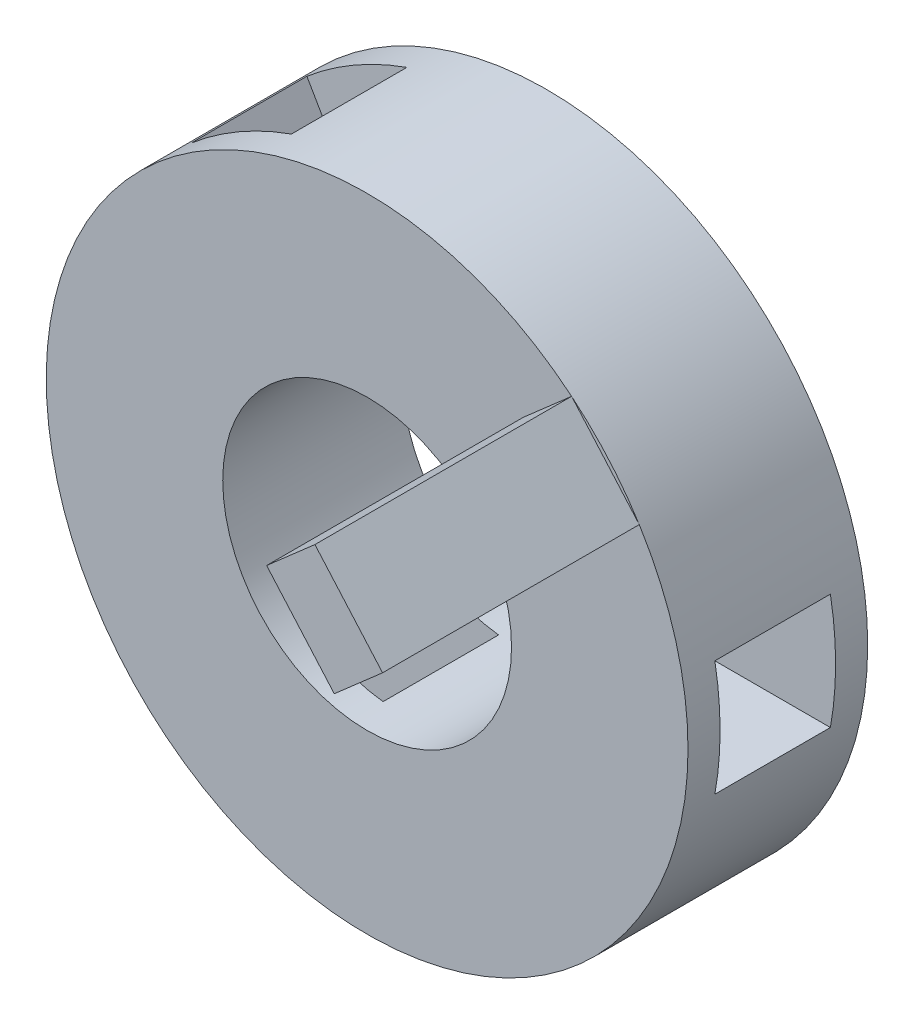
ISO-10303-21;
HEADER;
FILE_DESCRIPTION(('STEP AP214'),'2;1');
FILE_NAME('part.step','',(''),(''),'','','');
FILE_SCHEMA(('AUTOMOTIVE_DESIGN { 1 0 10303 214 1 1 1 1 }'));
ENDSEC;
DATA;
#1=APPLICATION_CONTEXT('core data for automotive mechanical design processes');
#2=APPLICATION_PROTOCOL_DEFINITION('international standard','automotive_design',2000,#1);
#3=PRODUCT_CONTEXT('',#1,'mechanical');
#4=PRODUCT('Part','Part','',(#3));
#5=PRODUCT_RELATED_PRODUCT_CATEGORY('part','',(#4));
#6=PRODUCT_DEFINITION_FORMATION('','',#4);
#7=PRODUCT_DEFINITION_CONTEXT('part definition',#1,'design');
#8=PRODUCT_DEFINITION('design','',#6,#7);
#9=PRODUCT_DEFINITION_SHAPE('','',#8);
#10=(LENGTH_UNIT() NAMED_UNIT(*) SI_UNIT(.MILLI.,.METRE.));
#11=(NAMED_UNIT(*) PLANE_ANGLE_UNIT() SI_UNIT($,.RADIAN.));
#12=(NAMED_UNIT(*) SI_UNIT($,.STERADIAN.) SOLID_ANGLE_UNIT());
#13=UNCERTAINTY_MEASURE_WITH_UNIT(LENGTH_MEASURE(1.E-05),#10,'distance_accuracy_value','');
#14=(GEOMETRIC_REPRESENTATION_CONTEXT(3) GLOBAL_UNCERTAINTY_ASSIGNED_CONTEXT((#13)) GLOBAL_UNIT_ASSIGNED_CONTEXT((#10,
#11,#12)) REPRESENTATION_CONTEXT('',''));
#15=CARTESIAN_POINT('',(0.,0.,0.));
#16=DIRECTION('',(0.,0.,1.));
#17=DIRECTION('',(1.,0.,0.));
#18=AXIS2_PLACEMENT_3D('',#15,#16,#17);
#19=CARTESIAN_POINT('',(0.,0.,14.));
#20=DIRECTION('',(0.,0.,1.));
#21=DIRECTION('',(1.,0.,0.));
#22=AXIS2_PLACEMENT_3D('',#19,#20,#21);
#23=PLANE('',#22);
#24=DIRECTION('',(0.658722413818782,-0.752386058837322,0.));
#25=VECTOR('',#24,1.);
#26=CARTESIAN_POINT('',(14.8053967065814,12.962290491101,14.));
#27=LINE('',#26,#25);
#28=CARTESIAN_POINT('',(12.1705070513063,15.9718347264503,14.));
#29=VERTEX_POINT('',#28);
#30=CARTESIAN_POINT('',(17.4402863618565,9.9527462557517,14.));
#31=VERTEX_POINT('',#30);
#32=EDGE_CURVE('E47',#29,#31,#27,.T.);
#33=ORIENTED_EDGE('',*,*,#32,.F.);
#34=DIRECTION('',(-0.752386058837322,-0.658722413818782,0.));
#35=VECTOR('',#34,1.);
#36=CARTESIAN_POINT('',(-2.63488965527514,3.0095442353493,14.));
#37=LINE('',#36,#35);
#38=CARTESIAN_POINT('',(15.9324373454929,19.2654467955442,14.));
#39=VERTEX_POINT('',#38);
#40=EDGE_CURVE('E163',#39,#29,#37,.T.);
#41=ORIENTED_EDGE('',*,*,#40,.F.);
#42=CARTESIAN_POINT('',(0.,0.,14.));
#43=DIRECTION('',(0.,0.,1.));
#44=DIRECTION('',(1.,0.,0.));
#45=AXIS2_PLACEMENT_3D('',#42,#43,#44);
#46=CIRCLE('',#45,25.);
#47=CARTESIAN_POINT('',(21.2022166560431,13.2463583248456,14.));
#48=VERTEX_POINT('',#47);
#49=EDGE_CURVE('E239',#39,#48,#46,.T.);
#50=ORIENTED_EDGE('',*,*,#49,.T.);
#51=DIRECTION('',(0.752386058837321,0.658722413818782,0.));
#52=VECTOR('',#51,1.);
#53=CARTESIAN_POINT('',(2.63488965527513,-3.00954423534929,14.));
#54=LINE('',#53,#52);
#55=EDGE_CURVE('E52',#31,#48,#54,.T.);
#56=ORIENTED_EDGE('',*,*,#55,.F.);
#57=EDGE_LOOP('',(#33,#41,#50,#56));
#58=FACE_BOUND('',#57,.T.);
#59=CARTESIAN_POINT('',(0.,0.,14.));
#60=DIRECTION('',(0.,0.,1.));
#61=DIRECTION('',(1.,0.,0.));
#62=AXIS2_PLACEMENT_3D('',#59,#60,#61);
#63=CIRCLE('',#62,11.25);
#64=CARTESIAN_POINT('',(11.25,0.,14.));
#65=VERTEX_POINT('',#64);
#66=EDGE_CURVE('E207',#65,#65,#63,.T.);
#67=ORIENTED_EDGE('',*,*,#66,.F.);
#68=EDGE_LOOP('',(#67));
#69=FACE_BOUND('',#68,.T.);
#70=ADVANCED_FACE('F32',(#58,#69),#23,.T.);
#71=CARTESIAN_POINT('',(0.,0.,14.));
#72=DIRECTION('',(0.,0.,-1.));
#73=DIRECTION('',(-1.,0.,0.));
#74=AXIS2_PLACEMENT_3D('',#71,#72,#73);
#75=CYLINDRICAL_SURFACE('',#74,25.);
#76=DIRECTION('',(0.,0.,-1.));
#77=VECTOR('',#76,1.);
#78=CARTESIAN_POINT('',(-8.39871831032775,23.5470068319471,14.));
#79=LINE('',#78,#77);
#80=CARTESIAN_POINT('',(-8.39871831032775,23.5470068319471,2.5));
#81=VERTEX_POINT('',#80);
#82=CARTESIAN_POINT('',(-8.39871831032775,23.5470068319471,11.5));
#83=VERTEX_POINT('',#82);
#84=EDGE_CURVE('E265',#81,#83,#79,.F.);
#85=ORIENTED_EDGE('',*,*,#84,.T.);
#86=CARTESIAN_POINT('',(0.,0.,11.5));
#87=DIRECTION('',(0.,0.,1.));
#88=DIRECTION('',(1.,0.,0.));
#89=AXIS2_PLACEMENT_3D('',#86,#87,#88);
#90=CIRCLE('',#89,25.);
#91=CARTESIAN_POINT('',(-16.1929469443877,19.0470068319472,11.5));
#92=VERTEX_POINT('',#91);
#93=EDGE_CURVE('E40',#83,#92,#90,.T.);
#94=ORIENTED_EDGE('',*,*,#93,.T.);
#95=DIRECTION('',(0.,0.,-1.));
#96=VECTOR('',#95,1.);
#97=CARTESIAN_POINT('',(-16.1929469443877,19.0470068319472,14.));
#98=LINE('',#97,#96);
#99=CARTESIAN_POINT('',(-16.1929469443877,19.0470068319472,2.5));
#100=VERTEX_POINT('',#99);
#101=EDGE_CURVE('E271',#92,#100,#98,.T.);
#102=ORIENTED_EDGE('',*,*,#101,.T.);
#103=CARTESIAN_POINT('',(0.,0.,2.5));
#104=DIRECTION('',(0.,0.,-1.));
#105=DIRECTION('',(-1.,0.,0.));
#106=AXIS2_PLACEMENT_3D('',#103,#104,#105);
#107=CIRCLE('',#106,25.);
#108=EDGE_CURVE('E268',#100,#81,#107,.T.);
#109=ORIENTED_EDGE('',*,*,#108,.T.);
#110=EDGE_LOOP('',(#85,#94,#102,#109));
#111=FACE_BOUND('',#110,.T.);
#112=DIRECTION('',(0.,0.,-1.));
#113=VECTOR('',#112,1.);
#114=CARTESIAN_POINT('',(-16.192946944388,-19.047006831947,14.));
#115=LINE('',#114,#113);
#116=CARTESIAN_POINT('',(-16.192946944388,-19.047006831947,2.5));
#117=VERTEX_POINT('',#116);
#118=CARTESIAN_POINT('',(-16.192946944388,-19.047006831947,11.5));
#119=VERTEX_POINT('',#118);
#120=EDGE_CURVE('E253',#117,#119,#115,.F.);
#121=ORIENTED_EDGE('',*,*,#120,.T.);
#122=CARTESIAN_POINT('',(0.,0.,11.5));
#123=DIRECTION('',(0.,0.,1.));
#124=DIRECTION('',(1.,0.,0.));
#125=AXIS2_PLACEMENT_3D('',#122,#123,#124);
#126=CIRCLE('',#125,25.);
#127=CARTESIAN_POINT('',(-8.39871831032807,-23.547006831947,11.5));
#128=VERTEX_POINT('',#127);
#129=EDGE_CURVE('E262',#119,#128,#126,.T.);
#130=ORIENTED_EDGE('',*,*,#129,.T.);
#131=DIRECTION('',(0.,0.,-1.));
#132=VECTOR('',#131,1.);
#133=CARTESIAN_POINT('',(-8.39871831032807,-23.547006831947,14.));
#134=LINE('',#133,#132);
#135=CARTESIAN_POINT('',(-8.39871831032807,-23.547006831947,2.5));
#136=VERTEX_POINT('',#135);
#137=EDGE_CURVE('E259',#128,#136,#134,.T.);
#138=ORIENTED_EDGE('',*,*,#137,.T.);
#139=CARTESIAN_POINT('',(0.,0.,2.5));
#140=DIRECTION('',(0.,0.,-1.));
#141=DIRECTION('',(-1.,0.,0.));
#142=AXIS2_PLACEMENT_3D('',#139,#140,#141);
#143=CIRCLE('',#142,25.);
#144=EDGE_CURVE('E256',#136,#117,#143,.T.);
#145=ORIENTED_EDGE('',*,*,#144,.T.);
#146=EDGE_LOOP('',(#121,#130,#138,#145));
#147=FACE_BOUND('',#146,.T.);
#148=DIRECTION('',(0.,0.,-1.));
#149=VECTOR('',#148,1.);
#150=CARTESIAN_POINT('',(24.5916652547159,-4.5,14.));
#151=LINE('',#150,#149);
#152=CARTESIAN_POINT('',(24.5916652547159,-4.5,2.5));
#153=VERTEX_POINT('',#152);
#154=CARTESIAN_POINT('',(24.5916652547159,-4.5,11.5));
#155=VERTEX_POINT('',#154);
#156=EDGE_CURVE('E238',#153,#155,#151,.F.);
#157=ORIENTED_EDGE('',*,*,#156,.T.);
#158=CARTESIAN_POINT('',(0.,0.,11.5));
#159=DIRECTION('',(0.,0.,1.));
#160=DIRECTION('',(0.,-1.,0.));
#161=AXIS2_PLACEMENT_3D('',#158,#159,#160);
#162=CIRCLE('',#161,25.);
#163=CARTESIAN_POINT('',(24.5916652547159,4.5,11.5));
#164=VERTEX_POINT('',#163);
#165=EDGE_CURVE('E250',#155,#164,#162,.T.);
#166=ORIENTED_EDGE('',*,*,#165,.T.);
#167=DIRECTION('',(0.,0.,-1.));
#168=VECTOR('',#167,1.);
#169=CARTESIAN_POINT('',(24.5916652547159,4.5,14.));
#170=LINE('',#169,#168);
#171=CARTESIAN_POINT('',(24.5916652547159,4.5,2.5));
#172=VERTEX_POINT('',#171);
#173=EDGE_CURVE('E247',#164,#172,#170,.T.);
#174=ORIENTED_EDGE('',*,*,#173,.T.);
#175=CARTESIAN_POINT('',(0.,0.,2.5));
#176=DIRECTION('',(0.,0.,-1.));
#177=DIRECTION('',(0.,1.,0.));
#178=AXIS2_PLACEMENT_3D('',#175,#176,#177);
#179=CIRCLE('',#178,25.);
#180=EDGE_CURVE('E244',#172,#153,#179,.T.);
#181=ORIENTED_EDGE('',*,*,#180,.T.);
#182=EDGE_LOOP('',(#157,#166,#174,#181));
#183=FACE_BOUND('',#182,.T.);
#184=EDGE_CURVE('E235',#48,#39,#46,.T.);
#185=ORIENTED_EDGE('',*,*,#184,.F.);
#186=ORIENTED_EDGE('',*,*,#49,.F.);
#187=EDGE_LOOP('',(#185,#186));
#188=FACE_BOUND('',#187,.T.);
#189=CARTESIAN_POINT('',(0.,0.,0.));
#190=DIRECTION('',(0.,0.,1.));
#191=DIRECTION('',(1.,0.,0.));
#192=AXIS2_PLACEMENT_3D('',#189,#190,#191);
#193=CIRCLE('',#192,25.);
#194=CARTESIAN_POINT('',(25.,0.,0.));
#195=VERTEX_POINT('',#194);
#196=EDGE_CURVE('E229',#195,#195,#193,.T.);
#197=ORIENTED_EDGE('',*,*,#196,.T.);
#198=EDGE_LOOP('',(#197));
#199=FACE_BOUND('',#198,.T.);
#200=ADVANCED_FACE('F34',(#111,#147,#183,#188,#199),#75,.T.);
#201=DIRECTION('',(-0.658722413818782,0.752386058837321,0.));
#202=VECTOR('',#201,1.);
#203=CARTESIAN_POINT('',(18.567327000768,16.2559025601949,14.));
#204=LINE('',#203,#202);
#205=EDGE_CURVE('E340',#48,#39,#204,.T.);
#206=ORIENTED_EDGE('',*,*,#205,.F.);
#207=ORIENTED_EDGE('',*,*,#184,.T.);
#208=EDGE_LOOP('',(#206,#207));
#209=FACE_BOUND('',#208,.T.);
#210=ADVANCED_FACE('F325',(#209),#23,.T.);
#211=CARTESIAN_POINT('',(0.,0.,0.));
#212=DIRECTION('',(0.,0.,1.));
#213=DIRECTION('',(1.,0.,0.));
#214=AXIS2_PLACEMENT_3D('',#211,#212,#213);
#215=PLANE('',#214);
#216=CARTESIAN_POINT('',(0.,0.,0.));
#217=DIRECTION('',(0.,0.,-1.));
#218=DIRECTION('',(-1.,0.,0.));
#219=AXIS2_PLACEMENT_3D('',#216,#217,#218);
#220=CIRCLE('',#219,11.25);
#221=CARTESIAN_POINT('',(-11.25,0.,0.));
#222=VERTEX_POINT('',#221);
#223=EDGE_CURVE('E166',#222,#222,#220,.T.);
#224=ORIENTED_EDGE('',*,*,#223,.F.);
#225=EDGE_LOOP('',(#224));
#226=FACE_BOUND('',#225,.T.);
#227=ORIENTED_EDGE('',*,*,#196,.F.);
#228=EDGE_LOOP('',(#227));
#229=FACE_BOUND('',#228,.T.);
#230=ADVANCED_FACE('F318',(#226,#229),#215,.F.);
#231=CARTESIAN_POINT('',(10.,4.5,11.5));
#232=DIRECTION('',(0.,0.,1.));
#233=DIRECTION('',(0.,-1.,0.));
#234=AXIS2_PLACEMENT_3D('',#231,#232,#233);
#235=PLANE('',#234);
#236=DIRECTION('',(1.,0.,0.));
#237=VECTOR('',#236,1.);
#238=CARTESIAN_POINT('',(10.,-4.5,11.5));
#239=LINE('',#238,#237);
#240=CARTESIAN_POINT('',(10.3107953136506,-4.5,11.5));
#241=VERTEX_POINT('',#240);
#242=EDGE_CURVE('E221',#241,#155,#239,.T.);
#243=ORIENTED_EDGE('',*,*,#242,.F.);
#244=CARTESIAN_POINT('',(0.,0.,11.5));
#245=DIRECTION('',(0.,0.,1.));
#246=DIRECTION('',(0.,-1.,0.));
#247=AXIS2_PLACEMENT_3D('',#244,#245,#246);
#248=CIRCLE('',#247,11.25);
#249=CARTESIAN_POINT('',(10.3107953136506,4.5,11.5));
#250=VERTEX_POINT('',#249);
#251=EDGE_CURVE('E204',#241,#250,#248,.T.);
#252=ORIENTED_EDGE('',*,*,#251,.T.);
#253=DIRECTION('',(1.,0.,0.));
#254=VECTOR('',#253,1.);
#255=CARTESIAN_POINT('',(10.,4.5,11.5));
#256=LINE('',#255,#254);
#257=EDGE_CURVE('E227',#250,#164,#256,.T.);
#258=ORIENTED_EDGE('',*,*,#257,.T.);
#259=ORIENTED_EDGE('',*,*,#165,.F.);
#260=EDGE_LOOP('',(#243,#252,#258,#259));
#261=FACE_BOUND('',#260,.T.);
#262=ADVANCED_FACE('F316',(#261),#235,.F.);
#263=CARTESIAN_POINT('',(10.,4.5,11.5));
#264=DIRECTION('',(0.,1.,0.));
#265=DIRECTION('',(0.,0.,1.));
#266=AXIS2_PLACEMENT_3D('',#263,#264,#265);
#267=PLANE('',#266);
#268=ORIENTED_EDGE('',*,*,#257,.F.);
#269=DIRECTION('',(0.,0.,-1.));
#270=VECTOR('',#269,1.);
#271=CARTESIAN_POINT('',(10.3107953136506,4.5,16.));
#272=LINE('',#271,#270);
#273=CARTESIAN_POINT('',(10.3107953136506,4.5,2.5));
#274=VERTEX_POINT('',#273);
#275=EDGE_CURVE('E201',#250,#274,#272,.T.);
#276=ORIENTED_EDGE('',*,*,#275,.T.);
#277=DIRECTION('',(1.,0.,0.));
#278=VECTOR('',#277,1.);
#279=CARTESIAN_POINT('',(10.,4.5,2.5));
#280=LINE('',#279,#278);
#281=EDGE_CURVE('E230',#274,#172,#280,.T.);
#282=ORIENTED_EDGE('',*,*,#281,.T.);
#283=ORIENTED_EDGE('',*,*,#173,.F.);
#284=EDGE_LOOP('',(#268,#276,#282,#283));
#285=FACE_BOUND('',#284,.T.);
#286=ADVANCED_FACE('F314',(#285),#267,.F.);
#287=CARTESIAN_POINT('',(10.,4.5,2.5));
#288=DIRECTION('',(0.,0.,-1.));
#289=DIRECTION('',(0.,1.,0.));
#290=AXIS2_PLACEMENT_3D('',#287,#288,#289);
#291=PLANE('',#290);
#292=ORIENTED_EDGE('',*,*,#281,.F.);
#293=CARTESIAN_POINT('',(0.,0.,2.5));
#294=DIRECTION('',(0.,0.,-1.));
#295=DIRECTION('',(0.,1.,0.));
#296=AXIS2_PLACEMENT_3D('',#293,#294,#295);
#297=CIRCLE('',#296,11.25);
#298=CARTESIAN_POINT('',(10.3107953136506,-4.5,2.5));
#299=VERTEX_POINT('',#298);
#300=EDGE_CURVE('E198',#274,#299,#297,.T.);
#301=ORIENTED_EDGE('',*,*,#300,.T.);
#302=DIRECTION('',(1.,0.,0.));
#303=VECTOR('',#302,1.);
#304=CARTESIAN_POINT('',(10.,-4.5,2.5));
#305=LINE('',#304,#303);
#306=EDGE_CURVE('E232',#299,#153,#305,.T.);
#307=ORIENTED_EDGE('',*,*,#306,.T.);
#308=ORIENTED_EDGE('',*,*,#180,.F.);
#309=EDGE_LOOP('',(#292,#301,#307,#308));
#310=FACE_BOUND('',#309,.T.);
#311=ADVANCED_FACE('F304',(#310),#291,.F.);
#312=CARTESIAN_POINT('',(10.,-4.5,11.5));
#313=DIRECTION('',(0.,-1.,0.));
#314=DIRECTION('',(0.,0.,-1.));
#315=AXIS2_PLACEMENT_3D('',#312,#313,#314);
#316=PLANE('',#315);
#317=ORIENTED_EDGE('',*,*,#306,.F.);
#318=DIRECTION('',(0.,0.,-1.));
#319=VECTOR('',#318,1.);
#320=CARTESIAN_POINT('',(10.3107953136506,-4.5,16.));
#321=LINE('',#320,#319);
#322=EDGE_CURVE('E195',#299,#241,#321,.F.);
#323=ORIENTED_EDGE('',*,*,#322,.T.);
#324=ORIENTED_EDGE('',*,*,#242,.T.);
#325=ORIENTED_EDGE('',*,*,#156,.F.);
#326=EDGE_LOOP('',(#317,#323,#324,#325));
#327=FACE_BOUND('',#326,.T.);
#328=ADVANCED_FACE('F307',(#327),#316,.F.);
#329=CARTESIAN_POINT('',(-1.10288568297008,-10.9102540378444,11.5));
#330=DIRECTION('',(0.,0.,1.));
#331=DIRECTION('',(1.,0.,0.));
#332=AXIS2_PLACEMENT_3D('',#329,#330,#331);
#333=PLANE('',#332);
#334=DIRECTION('',(-0.500000000000004,-0.866025403784436,0.));
#335=VECTOR('',#334,1.);
#336=CARTESIAN_POINT('',(-8.89711431703,-6.41025403784434,11.5));
#337=LINE('',#336,#335);
#338=CARTESIAN_POINT('',(-9.05251197385533,-6.67941067484295,11.5));
#339=VERTEX_POINT('',#338);
#340=EDGE_CURVE('E213',#339,#119,#337,.T.);
#341=ORIENTED_EDGE('',*,*,#340,.F.);
#342=CARTESIAN_POINT('',(0.,0.,11.5));
#343=DIRECTION('',(0.,0.,1.));
#344=DIRECTION('',(1.,0.,0.));
#345=AXIS2_PLACEMENT_3D('',#342,#343,#344);
#346=CIRCLE('',#345,11.25);
#347=CARTESIAN_POINT('',(-1.2582833397954,-11.179410674843,11.5));
#348=VERTEX_POINT('',#347);
#349=EDGE_CURVE('E192',#339,#348,#346,.T.);
#350=ORIENTED_EDGE('',*,*,#349,.T.);
#351=DIRECTION('',(-0.500000000000004,-0.866025403784436,0.));
#352=VECTOR('',#351,1.);
#353=CARTESIAN_POINT('',(-1.10288568297008,-10.9102540378444,11.5));
#354=LINE('',#353,#352);
#355=EDGE_CURVE('E219',#348,#128,#354,.T.);
#356=ORIENTED_EDGE('',*,*,#355,.T.);
#357=ORIENTED_EDGE('',*,*,#129,.F.);
#358=EDGE_LOOP('',(#341,#350,#356,#357));
#359=FACE_BOUND('',#358,.T.);
#360=ADVANCED_FACE('F385',(#359),#333,.F.);
#361=CARTESIAN_POINT('',(-1.10288568297008,-10.9102540378444,11.5));
#362=DIRECTION('',(0.866025403784436,-0.500000000000004,0.));
#363=DIRECTION('',(0.500000000000004,0.866025403784436,0.));
#364=AXIS2_PLACEMENT_3D('',#361,#362,#363);
#365=PLANE('',#364);
#366=ORIENTED_EDGE('',*,*,#355,.F.);
#367=DIRECTION('',(0.,0.,-1.));
#368=VECTOR('',#367,1.);
#369=CARTESIAN_POINT('',(-1.2582833397954,-11.179410674843,16.));
#370=LINE('',#369,#368);
#371=CARTESIAN_POINT('',(-1.2582833397954,-11.179410674843,2.5));
#372=VERTEX_POINT('',#371);
#373=EDGE_CURVE('E189',#348,#372,#370,.T.);
#374=ORIENTED_EDGE('',*,*,#373,.T.);
#375=DIRECTION('',(-0.500000000000004,-0.866025403784436,0.));
#376=VECTOR('',#375,1.);
#377=CARTESIAN_POINT('',(-1.10288568297008,-10.9102540378444,2.5));
#378=LINE('',#377,#376);
#379=EDGE_CURVE('E222',#372,#136,#378,.T.);
#380=ORIENTED_EDGE('',*,*,#379,.T.);
#381=ORIENTED_EDGE('',*,*,#137,.F.);
#382=EDGE_LOOP('',(#366,#374,#380,#381));
#383=FACE_BOUND('',#382,.T.);
#384=ADVANCED_FACE('F381',(#383),#365,.F.);
#385=CARTESIAN_POINT('',(-1.10288568297008,-10.9102540378444,2.5));
#386=DIRECTION('',(0.,0.,-1.));
#387=DIRECTION('',(-1.,0.,0.));
#388=AXIS2_PLACEMENT_3D('',#385,#386,#387);
#389=PLANE('',#388);
#390=ORIENTED_EDGE('',*,*,#379,.F.);
#391=CARTESIAN_POINT('',(0.,0.,2.5));
#392=DIRECTION('',(0.,0.,-1.));
#393=DIRECTION('',(-1.,0.,0.));
#394=AXIS2_PLACEMENT_3D('',#391,#392,#393);
#395=CIRCLE('',#394,11.25);
#396=CARTESIAN_POINT('',(-9.05251197385533,-6.67941067484295,2.5));
#397=VERTEX_POINT('',#396);
#398=EDGE_CURVE('E186',#372,#397,#395,.T.);
#399=ORIENTED_EDGE('',*,*,#398,.T.);
#400=DIRECTION('',(-0.500000000000004,-0.866025403784436,0.));
#401=VECTOR('',#400,1.);
#402=CARTESIAN_POINT('',(-8.89711431703,-6.41025403784434,2.5));
#403=LINE('',#402,#401);
#404=EDGE_CURVE('E224',#397,#117,#403,.T.);
#405=ORIENTED_EDGE('',*,*,#404,.T.);
#406=ORIENTED_EDGE('',*,*,#144,.F.);
#407=EDGE_LOOP('',(#390,#399,#405,#406));
#408=FACE_BOUND('',#407,.T.);
#409=ADVANCED_FACE('F384',(#408),#389,.F.);
#410=CARTESIAN_POINT('',(-8.89711431703,-6.41025403784434,11.5));
#411=DIRECTION('',(-0.866025403784436,0.500000000000004,0.));
#412=DIRECTION('',(-0.500000000000004,-0.866025403784436,0.));
#413=AXIS2_PLACEMENT_3D('',#410,#411,#412);
#414=PLANE('',#413);
#415=ORIENTED_EDGE('',*,*,#404,.F.);
#416=DIRECTION('',(0.,0.,-1.));
#417=VECTOR('',#416,1.);
#418=CARTESIAN_POINT('',(-9.05251197385533,-6.67941067484295,16.));
#419=LINE('',#418,#417);
#420=EDGE_CURVE('E183',#397,#339,#419,.F.);
#421=ORIENTED_EDGE('',*,*,#420,.T.);
#422=ORIENTED_EDGE('',*,*,#340,.T.);
#423=ORIENTED_EDGE('',*,*,#120,.F.);
#424=EDGE_LOOP('',(#415,#421,#422,#423));
#425=FACE_BOUND('',#424,.T.);
#426=ADVANCED_FACE('F380',(#425),#414,.F.);
#427=CARTESIAN_POINT('',(-8.89711431702991,6.41025403784447,11.5));
#428=DIRECTION('',(0.,0.,1.));
#429=DIRECTION('',(1.,0.,0.));
#430=AXIS2_PLACEMENT_3D('',#427,#428,#429);
#431=PLANE('',#430);
#432=DIRECTION('',(-0.499999999999992,0.866025403784443,0.));
#433=VECTOR('',#432,1.);
#434=CARTESIAN_POINT('',(-1.10288568296992,10.9102540378444,11.5));
#435=LINE('',#434,#433);
#436=CARTESIAN_POINT('',(-1.25828333979524,11.179410674843,11.5));
#437=VERTEX_POINT('',#436);
#438=EDGE_CURVE('E210',#437,#83,#435,.T.);
#439=ORIENTED_EDGE('',*,*,#438,.F.);
#440=CARTESIAN_POINT('',(0.,0.,11.5));
#441=DIRECTION('',(0.,0.,1.));
#442=DIRECTION('',(1.,0.,0.));
#443=AXIS2_PLACEMENT_3D('',#440,#441,#442);
#444=CIRCLE('',#443,11.25);
#445=CARTESIAN_POINT('',(-9.05251197385523,6.67941067484308,11.5));
#446=VERTEX_POINT('',#445);
#447=EDGE_CURVE('E180',#437,#446,#444,.T.);
#448=ORIENTED_EDGE('',*,*,#447,.T.);
#449=DIRECTION('',(-0.499999999999992,0.866025403784443,0.));
#450=VECTOR('',#449,1.);
#451=CARTESIAN_POINT('',(-8.89711431702991,6.41025403784447,11.5));
#452=LINE('',#451,#450);
#453=EDGE_CURVE('E211',#446,#92,#452,.T.);
#454=ORIENTED_EDGE('',*,*,#453,.T.);
#455=ORIENTED_EDGE('',*,*,#93,.F.);
#456=EDGE_LOOP('',(#439,#448,#454,#455));
#457=FACE_BOUND('',#456,.T.);
#458=ADVANCED_FACE('F281',(#457),#431,.F.);
#459=CARTESIAN_POINT('',(-8.89711431702991,6.41025403784447,11.5));
#460=DIRECTION('',(-0.866025403784443,-0.499999999999992,0.));
#461=DIRECTION('',(0.499999999999992,-0.866025403784443,0.));
#462=AXIS2_PLACEMENT_3D('',#459,#460,#461);
#463=PLANE('',#462);
#464=ORIENTED_EDGE('',*,*,#453,.F.);
#465=DIRECTION('',(0.,0.,-1.));
#466=VECTOR('',#465,1.);
#467=CARTESIAN_POINT('',(-9.05251197385523,6.67941067484308,16.));
#468=LINE('',#467,#466);
#469=CARTESIAN_POINT('',(-9.05251197385523,6.67941067484308,2.5));
#470=VERTEX_POINT('',#469);
#471=EDGE_CURVE('E177',#446,#470,#468,.T.);
#472=ORIENTED_EDGE('',*,*,#471,.T.);
#473=DIRECTION('',(-0.499999999999992,0.866025403784443,0.));
#474=VECTOR('',#473,1.);
#475=CARTESIAN_POINT('',(-8.89711431702991,6.41025403784447,2.5));
#476=LINE('',#475,#474);
#477=EDGE_CURVE('E214',#470,#100,#476,.T.);
#478=ORIENTED_EDGE('',*,*,#477,.T.);
#479=ORIENTED_EDGE('',*,*,#101,.F.);
#480=EDGE_LOOP('',(#464,#472,#478,#479));
#481=FACE_BOUND('',#480,.T.);
#482=ADVANCED_FACE('F284',(#481),#463,.F.);
#483=CARTESIAN_POINT('',(-8.89711431702991,6.41025403784447,2.5));
#484=DIRECTION('',(0.,0.,-1.));
#485=DIRECTION('',(-1.,0.,0.));
#486=AXIS2_PLACEMENT_3D('',#483,#484,#485);
#487=PLANE('',#486);
#488=ORIENTED_EDGE('',*,*,#477,.F.);
#489=CARTESIAN_POINT('',(0.,0.,2.5));
#490=DIRECTION('',(0.,0.,-1.));
#491=DIRECTION('',(-1.,0.,0.));
#492=AXIS2_PLACEMENT_3D('',#489,#490,#491);
#493=CIRCLE('',#492,11.25);
#494=CARTESIAN_POINT('',(-1.25828333979524,11.179410674843,2.5));
#495=VERTEX_POINT('',#494);
#496=EDGE_CURVE('E169',#470,#495,#493,.T.);
#497=ORIENTED_EDGE('',*,*,#496,.T.);
#498=DIRECTION('',(-0.499999999999992,0.866025403784443,0.));
#499=VECTOR('',#498,1.);
#500=CARTESIAN_POINT('',(-1.10288568296992,10.9102540378444,2.5));
#501=LINE('',#500,#499);
#502=EDGE_CURVE('E216',#495,#81,#501,.T.);
#503=ORIENTED_EDGE('',*,*,#502,.T.);
#504=ORIENTED_EDGE('',*,*,#108,.F.);
#505=EDGE_LOOP('',(#488,#497,#503,#504));
#506=FACE_BOUND('',#505,.T.);
#507=ADVANCED_FACE('F288',(#506),#487,.F.);
#508=CARTESIAN_POINT('',(-1.10288568296992,10.9102540378444,11.5));
#509=DIRECTION('',(0.866025403784443,0.499999999999992,0.));
#510=DIRECTION('',(-0.499999999999992,0.866025403784443,0.));
#511=AXIS2_PLACEMENT_3D('',#508,#509,#510);
#512=PLANE('',#511);
#513=ORIENTED_EDGE('',*,*,#502,.F.);
#514=DIRECTION('',(0.,0.,-1.));
#515=VECTOR('',#514,1.);
#516=CARTESIAN_POINT('',(-1.25828333979524,11.179410674843,16.));
#517=LINE('',#516,#515);
#518=EDGE_CURVE('E11',#495,#437,#517,.F.);
#519=ORIENTED_EDGE('',*,*,#518,.T.);
#520=ORIENTED_EDGE('',*,*,#438,.T.);
#521=ORIENTED_EDGE('',*,*,#84,.F.);
#522=EDGE_LOOP('',(#513,#519,#520,#521));
#523=FACE_BOUND('',#522,.T.);
#524=ADVANCED_FACE('F291',(#523),#512,.F.);
#525=CARTESIAN_POINT('',(0.,0.,16.));
#526=DIRECTION('',(0.,0.,-1.));
#527=DIRECTION('',(-1.,0.,0.));
#528=AXIS2_PLACEMENT_3D('',#525,#526,#527);
#529=CYLINDRICAL_SURFACE('',#528,11.25);
#530=ORIENTED_EDGE('',*,*,#66,.T.);
#531=EDGE_LOOP('',(#530));
#532=FACE_BOUND('',#531,.T.);
#533=ORIENTED_EDGE('',*,*,#223,.T.);
#534=EDGE_LOOP('',(#533));
#535=FACE_BOUND('',#534,.T.);
#536=ORIENTED_EDGE('',*,*,#518,.F.);
#537=ORIENTED_EDGE('',*,*,#496,.F.);
#538=ORIENTED_EDGE('',*,*,#471,.F.);
#539=ORIENTED_EDGE('',*,*,#447,.F.);
#540=EDGE_LOOP('',(#536,#537,#538,#539));
#541=FACE_BOUND('',#540,.T.);
#542=ORIENTED_EDGE('',*,*,#420,.F.);
#543=ORIENTED_EDGE('',*,*,#398,.F.);
#544=ORIENTED_EDGE('',*,*,#373,.F.);
#545=ORIENTED_EDGE('',*,*,#349,.F.);
#546=EDGE_LOOP('',(#542,#543,#544,#545));
#547=FACE_BOUND('',#546,.T.);
#548=ORIENTED_EDGE('',*,*,#322,.F.);
#549=ORIENTED_EDGE('',*,*,#300,.F.);
#550=ORIENTED_EDGE('',*,*,#275,.F.);
#551=ORIENTED_EDGE('',*,*,#251,.F.);
#552=EDGE_LOOP('',(#548,#549,#550,#551));
#553=FACE_BOUND('',#552,.T.);
#554=ADVANCED_FACE('F293',(#532,#535,#541,#547,#553),#529,.F.);
#555=CARTESIAN_POINT('',(14.8053967065814,12.962290491101,34.));
#556=DIRECTION('',(0.752386058837322,0.658722413818782,0.));
#557=DIRECTION('',(-0.658722413818782,0.752386058837322,0.));
#558=AXIS2_PLACEMENT_3D('',#555,#556,#557);
#559=PLANE('',#558);
#560=ORIENTED_EDGE('',*,*,#32,.T.);
#561=DIRECTION('',(0.,0.,-1.));
#562=VECTOR('',#561,1.);
#563=CARTESIAN_POINT('',(17.4402863618565,9.9527462557517,34.));
#564=LINE('',#563,#562);
#565=CARTESIAN_POINT('',(17.4402863618565,9.9527462557517,34.));
#566=VERTEX_POINT('',#565);
#567=EDGE_CURVE('E148',#566,#31,#564,.T.);
#568=ORIENTED_EDGE('',*,*,#567,.F.);
#569=DIRECTION('',(0.658722413818782,-0.752386058837322,0.));
#570=VECTOR('',#569,1.);
#571=CARTESIAN_POINT('',(14.8053967065814,12.962290491101,34.));
#572=LINE('',#571,#570);
#573=CARTESIAN_POINT('',(12.1705070513063,15.9718347264503,34.));
#574=VERTEX_POINT('',#573);
#575=EDGE_CURVE('E154',#574,#566,#572,.T.);
#576=ORIENTED_EDGE('',*,*,#575,.F.);
#577=DIRECTION('',(0.,0.,-1.));
#578=VECTOR('',#577,1.);
#579=CARTESIAN_POINT('',(12.1705070513063,15.9718347264503,34.));
#580=LINE('',#579,#578);
#581=EDGE_CURVE('E348',#574,#29,#580,.T.);
#582=ORIENTED_EDGE('',*,*,#581,.T.);
#583=EDGE_LOOP('',(#560,#568,#576,#582));
#584=FACE_BOUND('',#583,.T.);
#585=ADVANCED_FACE('F165',(#584),#559,.F.);
#586=CARTESIAN_POINT('',(2.63488965527513,-3.00954423534929,34.));
#587=DIRECTION('',(-0.658722413818782,0.752386058837321,0.));
#588=DIRECTION('',(-0.752386058837321,-0.658722413818782,0.));
#589=AXIS2_PLACEMENT_3D('',#586,#587,#588);
#590=PLANE('',#589);
#591=ORIENTED_EDGE('',*,*,#55,.T.);
#592=DIRECTION('',(0.,0.,-1.));
#593=VECTOR('',#592,1.);
#594=CARTESIAN_POINT('',(21.2022166560431,13.2463583248456,34.));
#595=LINE('',#594,#593);
#596=CARTESIAN_POINT('',(21.2022166560431,13.2463583248456,34.));
#597=VERTEX_POINT('',#596);
#598=EDGE_CURVE('E150',#597,#48,#595,.T.);
#599=ORIENTED_EDGE('',*,*,#598,.F.);
#600=DIRECTION('',(0.752386058837321,0.658722413818782,0.));
#601=VECTOR('',#600,1.);
#602=CARTESIAN_POINT('',(2.63488965527513,-3.00954423534929,34.));
#603=LINE('',#602,#601);
#604=EDGE_CURVE('E144',#566,#597,#603,.T.);
#605=ORIENTED_EDGE('',*,*,#604,.F.);
#606=ORIENTED_EDGE('',*,*,#567,.T.);
#607=EDGE_LOOP('',(#591,#599,#605,#606));
#608=FACE_BOUND('',#607,.T.);
#609=ADVANCED_FACE('F146',(#608),#590,.F.);
#610=CARTESIAN_POINT('',(18.567327000768,16.2559025601949,34.));
#611=DIRECTION('',(-0.752386058837321,-0.658722413818782,0.));
#612=DIRECTION('',(0.658722413818782,-0.752386058837321,0.));
#613=AXIS2_PLACEMENT_3D('',#610,#611,#612);
#614=PLANE('',#613);
#615=ORIENTED_EDGE('',*,*,#205,.T.);
#616=DIRECTION('',(0.,0.,-1.));
#617=VECTOR('',#616,1.);
#618=CARTESIAN_POINT('',(15.9324373454929,19.2654467955442,34.));
#619=LINE('',#618,#617);
#620=CARTESIAN_POINT('',(15.9324373454929,19.2654467955442,34.));
#621=VERTEX_POINT('',#620);
#622=EDGE_CURVE('E171',#621,#39,#619,.T.);
#623=ORIENTED_EDGE('',*,*,#622,.F.);
#624=DIRECTION('',(-0.658722413818782,0.752386058837321,0.));
#625=VECTOR('',#624,1.);
#626=CARTESIAN_POINT('',(18.567327000768,16.2559025601949,34.));
#627=LINE('',#626,#625);
#628=EDGE_CURVE('E153',#597,#621,#627,.T.);
#629=ORIENTED_EDGE('',*,*,#628,.F.);
#630=ORIENTED_EDGE('',*,*,#598,.T.);
#631=EDGE_LOOP('',(#615,#623,#629,#630));
#632=FACE_BOUND('',#631,.T.);
#633=ADVANCED_FACE('F346',(#632),#614,.F.);
#634=CARTESIAN_POINT('',(-2.63488965527514,3.0095442353493,34.));
#635=DIRECTION('',(0.658722413818782,-0.752386058837322,0.));
#636=DIRECTION('',(0.752386058837322,0.658722413818782,0.));
#637=AXIS2_PLACEMENT_3D('',#634,#635,#636);
#638=PLANE('',#637);
#639=ORIENTED_EDGE('',*,*,#40,.T.);
#640=ORIENTED_EDGE('',*,*,#581,.F.);
#641=DIRECTION('',(-0.752386058837322,-0.658722413818782,0.));
#642=VECTOR('',#641,1.);
#643=CARTESIAN_POINT('',(-2.63488965527514,3.0095442353493,34.));
#644=LINE('',#643,#642);
#645=EDGE_CURVE('E159',#621,#574,#644,.T.);
#646=ORIENTED_EDGE('',*,*,#645,.F.);
#647=ORIENTED_EDGE('',*,*,#622,.T.);
#648=EDGE_LOOP('',(#639,#640,#646,#647));
#649=FACE_BOUND('',#648,.T.);
#650=ADVANCED_FACE('F354',(#649),#638,.F.);
#651=CARTESIAN_POINT('',(0.,0.,34.));
#652=DIRECTION('',(0.,0.,1.));
#653=DIRECTION('',(1.,0.,0.));
#654=AXIS2_PLACEMENT_3D('',#651,#652,#653);
#655=PLANE('',#654);
#656=ORIENTED_EDGE('',*,*,#575,.T.);
#657=ORIENTED_EDGE('',*,*,#604,.T.);
#658=ORIENTED_EDGE('',*,*,#628,.T.);
#659=ORIENTED_EDGE('',*,*,#645,.T.);
#660=EDGE_LOOP('',(#656,#657,#658,#659));
#661=FACE_BOUND('',#660,.T.);
#662=ADVANCED_FACE('F157',(#661),#655,.T.);
#663=CLOSED_SHELL('',(#70,#200,#210,#230,#262,#286,#311,#328,#360,#384,#409,#426,#458,#482,#507,
#524,#554,#585,#609,#633,#650,#662));
#664=MANIFOLD_SOLID_BREP('B2',#663);
#665=ADVANCED_BREP_SHAPE_REPRESENTATION('',(#18,#664),#14);
#666=SHAPE_DEFINITION_REPRESENTATION(#9,#665);
ENDSEC;
END-ISO-10303-21;
